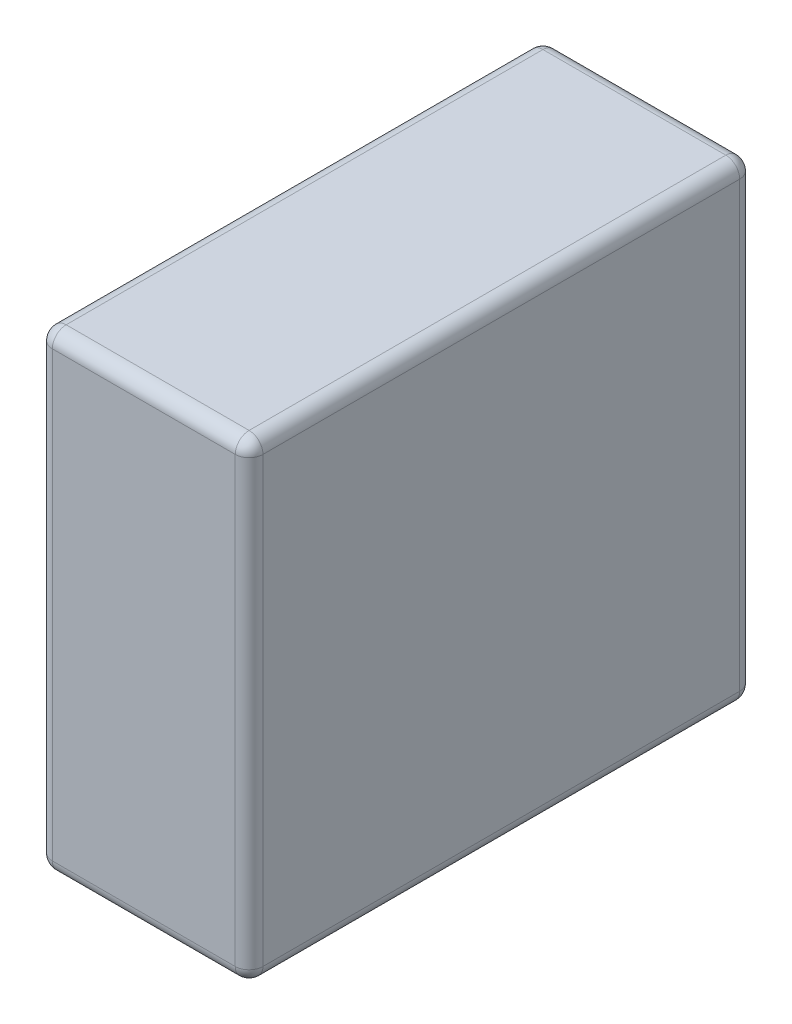
ISO-10303-21;
HEADER;
FILE_DESCRIPTION(('STEP AP214'),'2;1');
FILE_NAME('part.step','',(''),(''),'','','');
FILE_SCHEMA(('AUTOMOTIVE_DESIGN { 1 0 10303 214 1 1 1 1 }'));
ENDSEC;
DATA;
#1=APPLICATION_CONTEXT('core data for automotive mechanical design processes');
#2=APPLICATION_PROTOCOL_DEFINITION('international standard','automotive_design',2000,#1);
#3=PRODUCT_CONTEXT('',#1,'mechanical');
#4=PRODUCT('Part','Part','',(#3));
#5=PRODUCT_RELATED_PRODUCT_CATEGORY('part','',(#4));
#6=PRODUCT_DEFINITION_FORMATION('','',#4);
#7=PRODUCT_DEFINITION_CONTEXT('part definition',#1,'design');
#8=PRODUCT_DEFINITION('design','',#6,#7);
#9=PRODUCT_DEFINITION_SHAPE('','',#8);
#10=(LENGTH_UNIT() NAMED_UNIT(*) SI_UNIT(.MILLI.,.METRE.));
#11=(NAMED_UNIT(*) PLANE_ANGLE_UNIT() SI_UNIT($,.RADIAN.));
#12=(NAMED_UNIT(*) SI_UNIT($,.STERADIAN.) SOLID_ANGLE_UNIT());
#13=UNCERTAINTY_MEASURE_WITH_UNIT(LENGTH_MEASURE(1.E-05),#10,'distance_accuracy_value','');
#14=(GEOMETRIC_REPRESENTATION_CONTEXT(3) GLOBAL_UNCERTAINTY_ASSIGNED_CONTEXT((#13)) GLOBAL_UNIT_ASSIGNED_CONTEXT((#10,
#11,#12)) REPRESENTATION_CONTEXT('',''));
#15=CARTESIAN_POINT('',(0.,0.,0.));
#16=DIRECTION('',(0.,0.,1.));
#17=DIRECTION('',(1.,0.,0.));
#18=AXIS2_PLACEMENT_3D('',#15,#16,#17);
#19=CARTESIAN_POINT('',(-38.,170.,-91.));
#20=DIRECTION('',(1.,0.,0.));
#21=DIRECTION('',(0.,0.,-1.));
#22=AXIS2_PLACEMENT_3D('',#19,#20,#21);
#23=PLANE('',#22);
#24=DIRECTION('',(0.,0.,1.));
#25=VECTOR('',#24,1.);
#26=CARTESIAN_POINT('',(-38.,165.,-91.));
#27=LINE('',#26,#25);
#28=CARTESIAN_POINT('',(-38.,165.,86.));
#29=VERTEX_POINT('',#28);
#30=CARTESIAN_POINT('',(-38.,165.,-86.));
#31=VERTEX_POINT('',#30);
#32=EDGE_CURVE('E133',#29,#31,#27,.F.);
#33=ORIENTED_EDGE('',*,*,#32,.T.);
#34=DIRECTION('',(0.,-1.,0.));
#35=VECTOR('',#34,1.);
#36=CARTESIAN_POINT('',(-38.,170.,-86.));
#37=LINE('',#36,#35);
#38=CARTESIAN_POINT('',(-38.,5.,-86.));
#39=VERTEX_POINT('',#38);
#40=EDGE_CURVE('E170',#31,#39,#37,.T.);
#41=ORIENTED_EDGE('',*,*,#40,.T.);
#42=DIRECTION('',(0.,0.,1.));
#43=VECTOR('',#42,1.);
#44=CARTESIAN_POINT('',(-38.,5.,-91.));
#45=LINE('',#44,#43);
#46=CARTESIAN_POINT('',(-38.,5.,86.));
#47=VERTEX_POINT('',#46);
#48=EDGE_CURVE('E167',#39,#47,#45,.T.);
#49=ORIENTED_EDGE('',*,*,#48,.T.);
#50=DIRECTION('',(0.,-1.,0.));
#51=VECTOR('',#50,1.);
#52=CARTESIAN_POINT('',(-38.,170.,86.));
#53=LINE('',#52,#51);
#54=EDGE_CURVE('E162',#47,#29,#53,.F.);
#55=ORIENTED_EDGE('',*,*,#54,.T.);
#56=EDGE_LOOP('',(#33,#41,#49,#55));
#57=FACE_BOUND('',#56,.T.);
#58=ADVANCED_FACE('F37',(#57),#23,.F.);
#59=CARTESIAN_POINT('',(-38.,170.,91.));
#60=DIRECTION('',(0.,0.,-1.));
#61=DIRECTION('',(-1.,0.,0.));
#62=AXIS2_PLACEMENT_3D('',#59,#60,#61);
#63=PLANE('',#62);
#64=DIRECTION('',(0.,-1.,0.));
#65=VECTOR('',#64,1.);
#66=CARTESIAN_POINT('',(33.,170.,91.));
#67=LINE('',#66,#65);
#68=CARTESIAN_POINT('',(33.,5.,91.));
#69=VERTEX_POINT('',#68);
#70=CARTESIAN_POINT('',(33.,165.,91.));
#71=VERTEX_POINT('',#70);
#72=EDGE_CURVE('E46',#69,#71,#67,.F.);
#73=ORIENTED_EDGE('',*,*,#72,.T.);
#74=DIRECTION('',(1.,0.,0.));
#75=VECTOR('',#74,1.);
#76=CARTESIAN_POINT('',(-38.,165.,91.));
#77=LINE('',#76,#75);
#78=CARTESIAN_POINT('',(-33.,165.,91.));
#79=VERTEX_POINT('',#78);
#80=EDGE_CURVE('E11',#71,#79,#77,.F.);
#81=ORIENTED_EDGE('',*,*,#80,.T.);
#82=DIRECTION('',(0.,-1.,0.));
#83=VECTOR('',#82,1.);
#84=CARTESIAN_POINT('',(-33.,170.,91.));
#85=LINE('',#84,#83);
#86=CARTESIAN_POINT('',(-33.,5.,91.));
#87=VERTEX_POINT('',#86);
#88=EDGE_CURVE('E199',#79,#87,#85,.T.);
#89=ORIENTED_EDGE('',*,*,#88,.T.);
#90=DIRECTION('',(1.,0.,0.));
#91=VECTOR('',#90,1.);
#92=CARTESIAN_POINT('',(-38.,5.,91.));
#93=LINE('',#92,#91);
#94=EDGE_CURVE('E57',#87,#69,#93,.T.);
#95=ORIENTED_EDGE('',*,*,#94,.T.);
#96=EDGE_LOOP('',(#73,#81,#89,#95));
#97=FACE_BOUND('',#96,.T.);
#98=ADVANCED_FACE('F301',(#97),#63,.F.);
#99=CARTESIAN_POINT('',(38.,170.,-91.));
#100=DIRECTION('',(-1.,0.,0.));
#101=DIRECTION('',(0.,0.,1.));
#102=AXIS2_PLACEMENT_3D('',#99,#100,#101);
#103=PLANE('',#102);
#104=DIRECTION('',(0.,0.,-1.));
#105=VECTOR('',#104,1.);
#106=CARTESIAN_POINT('',(38.,5.,-91.));
#107=LINE('',#106,#105);
#108=CARTESIAN_POINT('',(38.,5.,86.));
#109=VERTEX_POINT('',#108);
#110=CARTESIAN_POINT('',(38.,5.,-86.));
#111=VERTEX_POINT('',#110);
#112=EDGE_CURVE('E183',#109,#111,#107,.T.);
#113=ORIENTED_EDGE('',*,*,#112,.T.);
#114=DIRECTION('',(0.,-1.,0.));
#115=VECTOR('',#114,1.);
#116=CARTESIAN_POINT('',(38.,170.,-86.));
#117=LINE('',#116,#115);
#118=CARTESIAN_POINT('',(38.,165.,-86.));
#119=VERTEX_POINT('',#118);
#120=EDGE_CURVE('E188',#111,#119,#117,.F.);
#121=ORIENTED_EDGE('',*,*,#120,.T.);
#122=DIRECTION('',(0.,0.,-1.));
#123=VECTOR('',#122,1.);
#124=CARTESIAN_POINT('',(38.,165.,91.));
#125=LINE('',#124,#123);
#126=CARTESIAN_POINT('',(38.,165.,86.));
#127=VERTEX_POINT('',#126);
#128=EDGE_CURVE('E185',#119,#127,#125,.F.);
#129=ORIENTED_EDGE('',*,*,#128,.T.);
#130=DIRECTION('',(0.,-1.,0.));
#131=VECTOR('',#130,1.);
#132=CARTESIAN_POINT('',(38.,170.,86.));
#133=LINE('',#132,#131);
#134=EDGE_CURVE('E181',#127,#109,#133,.T.);
#135=ORIENTED_EDGE('',*,*,#134,.T.);
#136=EDGE_LOOP('',(#113,#121,#129,#135));
#137=FACE_BOUND('',#136,.T.);
#138=ADVANCED_FACE('F303',(#137),#103,.F.);
#139=CARTESIAN_POINT('',(-38.,170.,-91.));
#140=DIRECTION('',(0.,0.,1.));
#141=DIRECTION('',(1.,0.,0.));
#142=AXIS2_PLACEMENT_3D('',#139,#140,#141);
#143=PLANE('',#142);
#144=DIRECTION('',(-1.,0.,0.));
#145=VECTOR('',#144,1.);
#146=CARTESIAN_POINT('',(38.,165.,-91.));
#147=LINE('',#146,#145);
#148=CARTESIAN_POINT('',(-33.,165.,-91.));
#149=VERTEX_POINT('',#148);
#150=CARTESIAN_POINT('',(33.,165.,-91.));
#151=VERTEX_POINT('',#150);
#152=EDGE_CURVE('E194',#149,#151,#147,.F.);
#153=ORIENTED_EDGE('',*,*,#152,.T.);
#154=DIRECTION('',(0.,-1.,0.));
#155=VECTOR('',#154,1.);
#156=CARTESIAN_POINT('',(33.,170.,-91.));
#157=LINE('',#156,#155);
#158=CARTESIAN_POINT('',(33.,5.,-91.));
#159=VERTEX_POINT('',#158);
#160=EDGE_CURVE('E196',#151,#159,#157,.T.);
#161=ORIENTED_EDGE('',*,*,#160,.T.);
#162=DIRECTION('',(-1.,0.,0.));
#163=VECTOR('',#162,1.);
#164=CARTESIAN_POINT('',(-38.,5.,-91.));
#165=LINE('',#164,#163);
#166=CARTESIAN_POINT('',(-33.,5.,-91.));
#167=VERTEX_POINT('',#166);
#168=EDGE_CURVE('E190',#159,#167,#165,.T.);
#169=ORIENTED_EDGE('',*,*,#168,.T.);
#170=DIRECTION('',(0.,-1.,0.));
#171=VECTOR('',#170,1.);
#172=CARTESIAN_POINT('',(-33.,170.,-91.));
#173=LINE('',#172,#171);
#174=EDGE_CURVE('E192',#167,#149,#173,.F.);
#175=ORIENTED_EDGE('',*,*,#174,.T.);
#176=EDGE_LOOP('',(#153,#161,#169,#175));
#177=FACE_BOUND('',#176,.T.);
#178=ADVANCED_FACE('F274',(#177),#143,.F.);
#179=CARTESIAN_POINT('',(0.,170.,0.));
#180=DIRECTION('',(0.,1.,0.));
#181=DIRECTION('',(0.,0.,1.));
#182=AXIS2_PLACEMENT_3D('',#179,#180,#181);
#183=PLANE('',#182);
#184=DIRECTION('',(0.,0.,-1.));
#185=VECTOR('',#184,1.);
#186=CARTESIAN_POINT('',(33.,170.,-91.));
#187=LINE('',#186,#185);
#188=CARTESIAN_POINT('',(33.,170.,86.));
#189=VERTEX_POINT('',#188);
#190=CARTESIAN_POINT('',(33.,170.,-86.));
#191=VERTEX_POINT('',#190);
#192=EDGE_CURVE('E155',#189,#191,#187,.T.);
#193=ORIENTED_EDGE('',*,*,#192,.T.);
#194=DIRECTION('',(-1.,0.,0.));
#195=VECTOR('',#194,1.);
#196=CARTESIAN_POINT('',(-38.,170.,-86.));
#197=LINE('',#196,#195);
#198=CARTESIAN_POINT('',(-33.,170.,-86.));
#199=VERTEX_POINT('',#198);
#200=EDGE_CURVE('E159',#191,#199,#197,.T.);
#201=ORIENTED_EDGE('',*,*,#200,.T.);
#202=DIRECTION('',(0.,0.,1.));
#203=VECTOR('',#202,1.);
#204=CARTESIAN_POINT('',(-33.,170.,91.));
#205=LINE('',#204,#203);
#206=CARTESIAN_POINT('',(-33.,170.,86.));
#207=VERTEX_POINT('',#206);
#208=EDGE_CURVE('E131',#199,#207,#205,.T.);
#209=ORIENTED_EDGE('',*,*,#208,.T.);
#210=DIRECTION('',(1.,0.,0.));
#211=VECTOR('',#210,1.);
#212=CARTESIAN_POINT('',(38.,170.,86.));
#213=LINE('',#212,#211);
#214=EDGE_CURVE('E149',#207,#189,#213,.T.);
#215=ORIENTED_EDGE('',*,*,#214,.T.);
#216=EDGE_LOOP('',(#193,#201,#209,#215));
#217=FACE_BOUND('',#216,.T.);
#218=ADVANCED_FACE('F157',(#217),#183,.T.);
#219=CARTESIAN_POINT('',(0.,0.,0.));
#220=DIRECTION('',(0.,1.,0.));
#221=DIRECTION('',(0.,0.,1.));
#222=AXIS2_PLACEMENT_3D('',#219,#220,#221);
#223=PLANE('',#222);
#224=DIRECTION('',(0.,0.,1.));
#225=VECTOR('',#224,1.);
#226=CARTESIAN_POINT('',(-33.,0.,0.));
#227=LINE('',#226,#225);
#228=CARTESIAN_POINT('',(-33.,0.,86.));
#229=VERTEX_POINT('',#228);
#230=CARTESIAN_POINT('',(-33.,0.,-86.));
#231=VERTEX_POINT('',#230);
#232=EDGE_CURVE('E176',#229,#231,#227,.F.);
#233=ORIENTED_EDGE('',*,*,#232,.T.);
#234=DIRECTION('',(-1.,0.,0.));
#235=VECTOR('',#234,1.);
#236=CARTESIAN_POINT('',(0.,0.,-86.));
#237=LINE('',#236,#235);
#238=CARTESIAN_POINT('',(33.,0.,-86.));
#239=VERTEX_POINT('',#238);
#240=EDGE_CURVE('E179',#231,#239,#237,.F.);
#241=ORIENTED_EDGE('',*,*,#240,.T.);
#242=DIRECTION('',(0.,0.,-1.));
#243=VECTOR('',#242,1.);
#244=CARTESIAN_POINT('',(33.,0.,0.));
#245=LINE('',#244,#243);
#246=CARTESIAN_POINT('',(33.,0.,86.));
#247=VERTEX_POINT('',#246);
#248=EDGE_CURVE('E174',#239,#247,#245,.F.);
#249=ORIENTED_EDGE('',*,*,#248,.T.);
#250=DIRECTION('',(1.,0.,0.));
#251=VECTOR('',#250,1.);
#252=CARTESIAN_POINT('',(0.,0.,86.));
#253=LINE('',#252,#251);
#254=EDGE_CURVE('E172',#247,#229,#253,.F.);
#255=ORIENTED_EDGE('',*,*,#254,.T.);
#256=EDGE_LOOP('',(#233,#241,#249,#255));
#257=FACE_BOUND('',#256,.T.);
#258=ADVANCED_FACE('F368',(#257),#223,.F.);
#259=CARTESIAN_POINT('',(33.,5.,-91.));
#260=DIRECTION('',(0.,0.,-1.));
#261=DIRECTION('',(-1.,0.,0.));
#262=AXIS2_PLACEMENT_3D('',#259,#260,#261);
#263=CYLINDRICAL_SURFACE('',#262,5.);
#264=CARTESIAN_POINT('',(33.,5.,-86.));
#265=DIRECTION('',(0.,0.,-1.));
#266=DIRECTION('',(-1.,0.,0.));
#267=AXIS2_PLACEMENT_3D('',#264,#265,#266);
#268=CIRCLE('',#267,5.);
#269=EDGE_CURVE('E41',#111,#239,#268,.T.);
#270=ORIENTED_EDGE('',*,*,#269,.F.);
#271=ORIENTED_EDGE('',*,*,#112,.F.);
#272=CARTESIAN_POINT('',(33.,5.,86.));
#273=DIRECTION('',(0.,0.,1.));
#274=DIRECTION('',(1.,0.,0.));
#275=AXIS2_PLACEMENT_3D('',#272,#273,#274);
#276=CIRCLE('',#275,5.);
#277=EDGE_CURVE('E252',#247,#109,#276,.T.);
#278=ORIENTED_EDGE('',*,*,#277,.F.);
#279=ORIENTED_EDGE('',*,*,#248,.F.);
#280=EDGE_LOOP('',(#270,#271,#278,#279));
#281=FACE_BOUND('',#280,.T.);
#282=ADVANCED_FACE('F39',(#281),#263,.T.);
#283=CARTESIAN_POINT('',(33.,5.,-86.));
#284=DIRECTION('',(0.,0.,1.));
#285=DIRECTION('',(1.,0.,0.));
#286=AXIS2_PLACEMENT_3D('',#283,#284,#285);
#287=SPHERICAL_SURFACE('',#286,5.);
#288=CARTESIAN_POINT('',(33.,5.,-86.));
#289=DIRECTION('',(0.,-1.,0.));
#290=DIRECTION('',(0.,0.,-1.));
#291=AXIS2_PLACEMENT_3D('',#288,#289,#290);
#292=CIRCLE('',#291,5.);
#293=EDGE_CURVE('E247',#111,#159,#292,.F.);
#294=ORIENTED_EDGE('',*,*,#293,.F.);
#295=ORIENTED_EDGE('',*,*,#269,.T.);
#296=CARTESIAN_POINT('',(33.,5.,-86.));
#297=DIRECTION('',(1.,0.,0.));
#298=DIRECTION('',(0.,0.,-1.));
#299=AXIS2_PLACEMENT_3D('',#296,#297,#298);
#300=CIRCLE('',#299,5.);
#301=EDGE_CURVE('E250',#159,#239,#300,.F.);
#302=ORIENTED_EDGE('',*,*,#301,.F.);
#303=EDGE_LOOP('',(#294,#295,#302));
#304=FACE_BOUND('',#303,.T.);
#305=ADVANCED_FACE('F263',(#304),#287,.T.);
#306=CARTESIAN_POINT('',(33.,5.,86.));
#307=DIRECTION('',(0.,0.,1.));
#308=DIRECTION('',(1.,0.,0.));
#309=AXIS2_PLACEMENT_3D('',#306,#307,#308);
#310=SPHERICAL_SURFACE('',#309,5.);
#311=CARTESIAN_POINT('',(33.,5.,86.));
#312=DIRECTION('',(1.,0.,0.));
#313=DIRECTION('',(0.,0.,-1.));
#314=AXIS2_PLACEMENT_3D('',#311,#312,#313);
#315=CIRCLE('',#314,5.);
#316=EDGE_CURVE('E242',#247,#69,#315,.F.);
#317=ORIENTED_EDGE('',*,*,#316,.F.);
#318=ORIENTED_EDGE('',*,*,#277,.T.);
#319=CARTESIAN_POINT('',(33.,5.,86.));
#320=DIRECTION('',(0.,-1.,0.));
#321=DIRECTION('',(0.,0.,-1.));
#322=AXIS2_PLACEMENT_3D('',#319,#320,#321);
#323=CIRCLE('',#322,5.);
#324=EDGE_CURVE('E244',#69,#109,#323,.F.);
#325=ORIENTED_EDGE('',*,*,#324,.F.);
#326=EDGE_LOOP('',(#317,#318,#325));
#327=FACE_BOUND('',#326,.T.);
#328=ADVANCED_FACE('F362',(#327),#310,.T.);
#329=CARTESIAN_POINT('',(-38.,5.,-86.));
#330=DIRECTION('',(-1.,0.,0.));
#331=DIRECTION('',(0.,0.,1.));
#332=AXIS2_PLACEMENT_3D('',#329,#330,#331);
#333=CYLINDRICAL_SURFACE('',#332,5.);
#334=ORIENTED_EDGE('',*,*,#301,.T.);
#335=ORIENTED_EDGE('',*,*,#240,.F.);
#336=CARTESIAN_POINT('',(-33.,5.,-86.));
#337=DIRECTION('',(-1.,0.,0.));
#338=DIRECTION('',(0.,0.,1.));
#339=AXIS2_PLACEMENT_3D('',#336,#337,#338);
#340=CIRCLE('',#339,5.);
#341=EDGE_CURVE('E237',#167,#231,#340,.T.);
#342=ORIENTED_EDGE('',*,*,#341,.F.);
#343=ORIENTED_EDGE('',*,*,#168,.F.);
#344=EDGE_LOOP('',(#334,#335,#342,#343));
#345=FACE_BOUND('',#344,.T.);
#346=ADVANCED_FACE('F270',(#345),#333,.T.);
#347=CARTESIAN_POINT('',(33.,170.,-86.));
#348=DIRECTION('',(0.,-1.,0.));
#349=DIRECTION('',(0.,0.,-1.));
#350=AXIS2_PLACEMENT_3D('',#347,#348,#349);
#351=CYLINDRICAL_SURFACE('',#350,5.);
#352=ORIENTED_EDGE('',*,*,#293,.T.);
#353=ORIENTED_EDGE('',*,*,#160,.F.);
#354=CARTESIAN_POINT('',(33.,165.,-86.));
#355=DIRECTION('',(0.,1.,0.));
#356=DIRECTION('',(0.,0.,1.));
#357=AXIS2_PLACEMENT_3D('',#354,#355,#356);
#358=CIRCLE('',#357,5.);
#359=EDGE_CURVE('E234',#119,#151,#358,.T.);
#360=ORIENTED_EDGE('',*,*,#359,.F.);
#361=ORIENTED_EDGE('',*,*,#120,.F.);
#362=EDGE_LOOP('',(#352,#353,#360,#361));
#363=FACE_BOUND('',#362,.T.);
#364=ADVANCED_FACE('F280',(#363),#351,.T.);
#365=CARTESIAN_POINT('',(33.,165.,0.));
#366=DIRECTION('',(0.,0.,1.));
#367=DIRECTION('',(1.,0.,0.));
#368=AXIS2_PLACEMENT_3D('',#365,#366,#367);
#369=CYLINDRICAL_SURFACE('',#368,5.);
#370=CARTESIAN_POINT('',(33.,165.,86.));
#371=DIRECTION('',(0.,0.,1.));
#372=DIRECTION('',(1.,0.,0.));
#373=AXIS2_PLACEMENT_3D('',#370,#371,#372);
#374=CIRCLE('',#373,5.);
#375=EDGE_CURVE('E228',#127,#189,#374,.T.);
#376=ORIENTED_EDGE('',*,*,#375,.F.);
#377=ORIENTED_EDGE('',*,*,#128,.F.);
#378=CARTESIAN_POINT('',(33.,165.,-86.));
#379=DIRECTION('',(0.,0.,-1.));
#380=DIRECTION('',(-1.,0.,0.));
#381=AXIS2_PLACEMENT_3D('',#378,#379,#380);
#382=CIRCLE('',#381,5.);
#383=EDGE_CURVE('E231',#191,#119,#382,.T.);
#384=ORIENTED_EDGE('',*,*,#383,.F.);
#385=ORIENTED_EDGE('',*,*,#192,.F.);
#386=EDGE_LOOP('',(#376,#377,#384,#385));
#387=FACE_BOUND('',#386,.T.);
#388=ADVANCED_FACE('F353',(#387),#369,.T.);
#389=CARTESIAN_POINT('',(33.,170.,86.));
#390=DIRECTION('',(0.,-1.,0.));
#391=DIRECTION('',(0.,0.,-1.));
#392=AXIS2_PLACEMENT_3D('',#389,#390,#391);
#393=CYLINDRICAL_SURFACE('',#392,5.);
#394=ORIENTED_EDGE('',*,*,#324,.T.);
#395=ORIENTED_EDGE('',*,*,#134,.F.);
#396=CARTESIAN_POINT('',(33.,165.,86.));
#397=DIRECTION('',(0.,1.,0.));
#398=DIRECTION('',(0.,0.,1.));
#399=AXIS2_PLACEMENT_3D('',#396,#397,#398);
#400=CIRCLE('',#399,5.);
#401=EDGE_CURVE('E226',#71,#127,#400,.T.);
#402=ORIENTED_EDGE('',*,*,#401,.F.);
#403=ORIENTED_EDGE('',*,*,#72,.F.);
#404=EDGE_LOOP('',(#394,#395,#402,#403));
#405=FACE_BOUND('',#404,.T.);
#406=ADVANCED_FACE('F349',(#405),#393,.T.);
#407=CARTESIAN_POINT('',(-38.,5.,86.));
#408=DIRECTION('',(1.,0.,0.));
#409=DIRECTION('',(0.,0.,-1.));
#410=AXIS2_PLACEMENT_3D('',#407,#408,#409);
#411=CYLINDRICAL_SURFACE('',#410,5.);
#412=ORIENTED_EDGE('',*,*,#316,.T.);
#413=ORIENTED_EDGE('',*,*,#94,.F.);
#414=CARTESIAN_POINT('',(-33.,5.,86.));
#415=DIRECTION('',(-1.,0.,0.));
#416=DIRECTION('',(0.,0.,1.));
#417=AXIS2_PLACEMENT_3D('',#414,#415,#416);
#418=CIRCLE('',#417,5.);
#419=EDGE_CURVE('E223',#229,#87,#418,.T.);
#420=ORIENTED_EDGE('',*,*,#419,.F.);
#421=ORIENTED_EDGE('',*,*,#254,.F.);
#422=EDGE_LOOP('',(#412,#413,#420,#421));
#423=FACE_BOUND('',#422,.T.);
#424=ADVANCED_FACE('F345',(#423),#411,.T.);
#425=CARTESIAN_POINT('',(-33.,5.,-91.));
#426=DIRECTION('',(0.,0.,1.));
#427=DIRECTION('',(1.,0.,0.));
#428=AXIS2_PLACEMENT_3D('',#425,#426,#427);
#429=CYLINDRICAL_SURFACE('',#428,5.);
#430=CARTESIAN_POINT('',(-33.,5.,-86.));
#431=DIRECTION('',(0.,0.,-1.));
#432=DIRECTION('',(-1.,0.,0.));
#433=AXIS2_PLACEMENT_3D('',#430,#431,#432);
#434=CIRCLE('',#433,5.);
#435=EDGE_CURVE('E239',#231,#39,#434,.T.);
#436=ORIENTED_EDGE('',*,*,#435,.F.);
#437=ORIENTED_EDGE('',*,*,#232,.F.);
#438=CARTESIAN_POINT('',(-33.,5.,86.));
#439=DIRECTION('',(0.,0.,1.));
#440=DIRECTION('',(1.,0.,0.));
#441=AXIS2_PLACEMENT_3D('',#438,#439,#440);
#442=CIRCLE('',#441,5.);
#443=EDGE_CURVE('E220',#47,#229,#442,.T.);
#444=ORIENTED_EDGE('',*,*,#443,.F.);
#445=ORIENTED_EDGE('',*,*,#48,.F.);
#446=EDGE_LOOP('',(#436,#437,#444,#445));
#447=FACE_BOUND('',#446,.T.);
#448=ADVANCED_FACE('F341',(#447),#429,.T.);
#449=CARTESIAN_POINT('',(-33.,5.,-86.));
#450=DIRECTION('',(0.,0.,1.));
#451=DIRECTION('',(1.,0.,0.));
#452=AXIS2_PLACEMENT_3D('',#449,#450,#451);
#453=SPHERICAL_SURFACE('',#452,5.);
#454=ORIENTED_EDGE('',*,*,#341,.T.);
#455=ORIENTED_EDGE('',*,*,#435,.T.);
#456=CARTESIAN_POINT('',(-33.,5.,-86.));
#457=DIRECTION('',(0.,-1.,0.));
#458=DIRECTION('',(0.,0.,-1.));
#459=AXIS2_PLACEMENT_3D('',#456,#457,#458);
#460=CIRCLE('',#459,5.);
#461=EDGE_CURVE('E217',#167,#39,#460,.F.);
#462=ORIENTED_EDGE('',*,*,#461,.F.);
#463=EDGE_LOOP('',(#454,#455,#462));
#464=FACE_BOUND('',#463,.T.);
#465=ADVANCED_FACE('F338',(#464),#453,.T.);
#466=CARTESIAN_POINT('',(33.,165.,-86.));
#467=DIRECTION('',(0.,0.,1.));
#468=DIRECTION('',(1.,0.,0.));
#469=AXIS2_PLACEMENT_3D('',#466,#467,#468);
#470=SPHERICAL_SURFACE('',#469,5.);
#471=ORIENTED_EDGE('',*,*,#383,.T.);
#472=ORIENTED_EDGE('',*,*,#359,.T.);
#473=CARTESIAN_POINT('',(33.,165.,-86.));
#474=DIRECTION('',(1.,0.,0.));
#475=DIRECTION('',(0.,1.,0.));
#476=AXIS2_PLACEMENT_3D('',#473,#474,#475);
#477=CIRCLE('',#476,5.);
#478=EDGE_CURVE('E214',#191,#151,#477,.F.);
#479=ORIENTED_EDGE('',*,*,#478,.F.);
#480=EDGE_LOOP('',(#471,#472,#479));
#481=FACE_BOUND('',#480,.T.);
#482=ADVANCED_FACE('F283',(#481),#470,.T.);
#483=CARTESIAN_POINT('',(33.,165.,86.));
#484=DIRECTION('',(0.,0.,1.));
#485=DIRECTION('',(1.,0.,0.));
#486=AXIS2_PLACEMENT_3D('',#483,#484,#485);
#487=SPHERICAL_SURFACE('',#486,5.);
#488=ORIENTED_EDGE('',*,*,#401,.T.);
#489=ORIENTED_EDGE('',*,*,#375,.T.);
#490=CARTESIAN_POINT('',(33.,165.,86.));
#491=DIRECTION('',(1.,0.,0.));
#492=DIRECTION('',(0.,0.,-1.));
#493=AXIS2_PLACEMENT_3D('',#490,#491,#492);
#494=CIRCLE('',#493,5.);
#495=EDGE_CURVE('E152',#71,#189,#494,.F.);
#496=ORIENTED_EDGE('',*,*,#495,.F.);
#497=EDGE_LOOP('',(#488,#489,#496));
#498=FACE_BOUND('',#497,.T.);
#499=ADVANCED_FACE('F331',(#498),#487,.T.);
#500=CARTESIAN_POINT('',(-33.,5.,86.));
#501=DIRECTION('',(0.,0.,1.));
#502=DIRECTION('',(1.,0.,0.));
#503=AXIS2_PLACEMENT_3D('',#500,#501,#502);
#504=SPHERICAL_SURFACE('',#503,5.);
#505=ORIENTED_EDGE('',*,*,#443,.T.);
#506=ORIENTED_EDGE('',*,*,#419,.T.);
#507=CARTESIAN_POINT('',(-33.,5.,86.));
#508=DIRECTION('',(0.,-1.,0.));
#509=DIRECTION('',(0.,0.,-1.));
#510=AXIS2_PLACEMENT_3D('',#507,#508,#509);
#511=CIRCLE('',#510,5.);
#512=EDGE_CURVE('E210',#47,#87,#511,.F.);
#513=ORIENTED_EDGE('',*,*,#512,.F.);
#514=EDGE_LOOP('',(#505,#506,#513));
#515=FACE_BOUND('',#514,.T.);
#516=ADVANCED_FACE('F328',(#515),#504,.T.);
#517=CARTESIAN_POINT('',(-33.,170.,-86.));
#518=DIRECTION('',(0.,-1.,0.));
#519=DIRECTION('',(0.,0.,-1.));
#520=AXIS2_PLACEMENT_3D('',#517,#518,#519);
#521=CYLINDRICAL_SURFACE('',#520,5.);
#522=ORIENTED_EDGE('',*,*,#461,.T.);
#523=ORIENTED_EDGE('',*,*,#40,.F.);
#524=CARTESIAN_POINT('',(-33.,165.,-86.));
#525=DIRECTION('',(0.,1.,0.));
#526=DIRECTION('',(0.,0.,1.));
#527=AXIS2_PLACEMENT_3D('',#524,#525,#526);
#528=CIRCLE('',#527,5.);
#529=EDGE_CURVE('E207',#149,#31,#528,.T.);
#530=ORIENTED_EDGE('',*,*,#529,.F.);
#531=ORIENTED_EDGE('',*,*,#174,.F.);
#532=EDGE_LOOP('',(#522,#523,#530,#531));
#533=FACE_BOUND('',#532,.T.);
#534=ADVANCED_FACE('F293',(#533),#521,.T.);
#535=CARTESIAN_POINT('',(0.,165.,-86.));
#536=DIRECTION('',(1.,0.,0.));
#537=DIRECTION('',(0.,0.,-1.));
#538=AXIS2_PLACEMENT_3D('',#535,#536,#537);
#539=CYLINDRICAL_SURFACE('',#538,5.);
#540=ORIENTED_EDGE('',*,*,#478,.T.);
#541=ORIENTED_EDGE('',*,*,#152,.F.);
#542=CARTESIAN_POINT('',(-33.,165.,-86.));
#543=DIRECTION('',(-1.,0.,0.));
#544=DIRECTION('',(0.,0.,1.));
#545=AXIS2_PLACEMENT_3D('',#542,#543,#544);
#546=CIRCLE('',#545,5.);
#547=EDGE_CURVE('E146',#199,#149,#546,.T.);
#548=ORIENTED_EDGE('',*,*,#547,.F.);
#549=ORIENTED_EDGE('',*,*,#200,.F.);
#550=EDGE_LOOP('',(#540,#541,#548,#549));
#551=FACE_BOUND('',#550,.T.);
#552=ADVANCED_FACE('F286',(#551),#539,.T.);
#553=CARTESIAN_POINT('',(0.,165.,86.));
#554=DIRECTION('',(-1.,0.,0.));
#555=DIRECTION('',(0.,0.,1.));
#556=AXIS2_PLACEMENT_3D('',#553,#554,#555);
#557=CYLINDRICAL_SURFACE('',#556,5.);
#558=ORIENTED_EDGE('',*,*,#495,.T.);
#559=ORIENTED_EDGE('',*,*,#214,.F.);
#560=CARTESIAN_POINT('',(-33.,165.,86.));
#561=DIRECTION('',(-1.,0.,0.));
#562=DIRECTION('',(0.,0.,1.));
#563=AXIS2_PLACEMENT_3D('',#560,#561,#562);
#564=CIRCLE('',#563,5.);
#565=EDGE_CURVE('E138',#79,#207,#564,.T.);
#566=ORIENTED_EDGE('',*,*,#565,.F.);
#567=ORIENTED_EDGE('',*,*,#80,.F.);
#568=EDGE_LOOP('',(#558,#559,#566,#567));
#569=FACE_BOUND('',#568,.T.);
#570=ADVANCED_FACE('F150',(#569),#557,.T.);
#571=CARTESIAN_POINT('',(-33.,170.,86.));
#572=DIRECTION('',(0.,-1.,0.));
#573=DIRECTION('',(0.,0.,-1.));
#574=AXIS2_PLACEMENT_3D('',#571,#572,#573);
#575=CYLINDRICAL_SURFACE('',#574,5.);
#576=ORIENTED_EDGE('',*,*,#512,.T.);
#577=ORIENTED_EDGE('',*,*,#88,.F.);
#578=CARTESIAN_POINT('',(-33.,165.,86.));
#579=DIRECTION('',(0.,1.,0.));
#580=DIRECTION('',(0.,0.,1.));
#581=AXIS2_PLACEMENT_3D('',#578,#579,#580);
#582=CIRCLE('',#581,5.);
#583=EDGE_CURVE('E142',#29,#79,#582,.T.);
#584=ORIENTED_EDGE('',*,*,#583,.F.);
#585=ORIENTED_EDGE('',*,*,#54,.F.);
#586=EDGE_LOOP('',(#576,#577,#584,#585));
#587=FACE_BOUND('',#586,.T.);
#588=ADVANCED_FACE('F299',(#587),#575,.T.);
#589=CARTESIAN_POINT('',(-33.,165.,-86.));
#590=DIRECTION('',(0.,0.,1.));
#591=DIRECTION('',(1.,0.,0.));
#592=AXIS2_PLACEMENT_3D('',#589,#590,#591);
#593=SPHERICAL_SURFACE('',#592,5.);
#594=ORIENTED_EDGE('',*,*,#547,.T.);
#595=ORIENTED_EDGE('',*,*,#529,.T.);
#596=CARTESIAN_POINT('',(-33.,165.,-86.));
#597=DIRECTION('',(0.,0.,-1.));
#598=DIRECTION('',(-1.,0.,0.));
#599=AXIS2_PLACEMENT_3D('',#596,#597,#598);
#600=CIRCLE('',#599,5.);
#601=EDGE_CURVE('E135',#199,#31,#600,.F.);
#602=ORIENTED_EDGE('',*,*,#601,.F.);
#603=EDGE_LOOP('',(#594,#595,#602));
#604=FACE_BOUND('',#603,.T.);
#605=ADVANCED_FACE('F290',(#604),#593,.T.);
#606=CARTESIAN_POINT('',(-33.,165.,86.));
#607=DIRECTION('',(0.,0.,1.));
#608=DIRECTION('',(1.,0.,0.));
#609=AXIS2_PLACEMENT_3D('',#606,#607,#608);
#610=SPHERICAL_SURFACE('',#609,5.);
#611=ORIENTED_EDGE('',*,*,#583,.T.);
#612=ORIENTED_EDGE('',*,*,#565,.T.);
#613=CARTESIAN_POINT('',(-33.,165.,86.));
#614=DIRECTION('',(0.,0.,1.));
#615=DIRECTION('',(1.,0.,0.));
#616=AXIS2_PLACEMENT_3D('',#613,#614,#615);
#617=CIRCLE('',#616,5.);
#618=EDGE_CURVE('E127',#29,#207,#617,.F.);
#619=ORIENTED_EDGE('',*,*,#618,.F.);
#620=EDGE_LOOP('',(#611,#612,#619));
#621=FACE_BOUND('',#620,.T.);
#622=ADVANCED_FACE('F140',(#621),#610,.T.);
#623=CARTESIAN_POINT('',(-33.,165.,0.));
#624=DIRECTION('',(0.,0.,-1.));
#625=DIRECTION('',(-1.,0.,0.));
#626=AXIS2_PLACEMENT_3D('',#623,#624,#625);
#627=CYLINDRICAL_SURFACE('',#626,5.);
#628=ORIENTED_EDGE('',*,*,#601,.T.);
#629=ORIENTED_EDGE('',*,*,#32,.F.);
#630=ORIENTED_EDGE('',*,*,#618,.T.);
#631=ORIENTED_EDGE('',*,*,#208,.F.);
#632=EDGE_LOOP('',(#628,#629,#630,#631));
#633=FACE_BOUND('',#632,.T.);
#634=ADVANCED_FACE('F129',(#633),#627,.T.);
#635=CLOSED_SHELL('',(#58,#98,#138,#178,#218,#258,#282,#305,#328,#346,#364,#388,#406,#424,#448,
#465,#482,#499,#516,#534,#552,#570,#588,#605,#622,#634));
#636=MANIFOLD_SOLID_BREP('B2',#635);
#637=ADVANCED_BREP_SHAPE_REPRESENTATION('',(#18,#636),#14);
#638=SHAPE_DEFINITION_REPRESENTATION(#9,#637);
ENDSEC;
END-ISO-10303-21;
